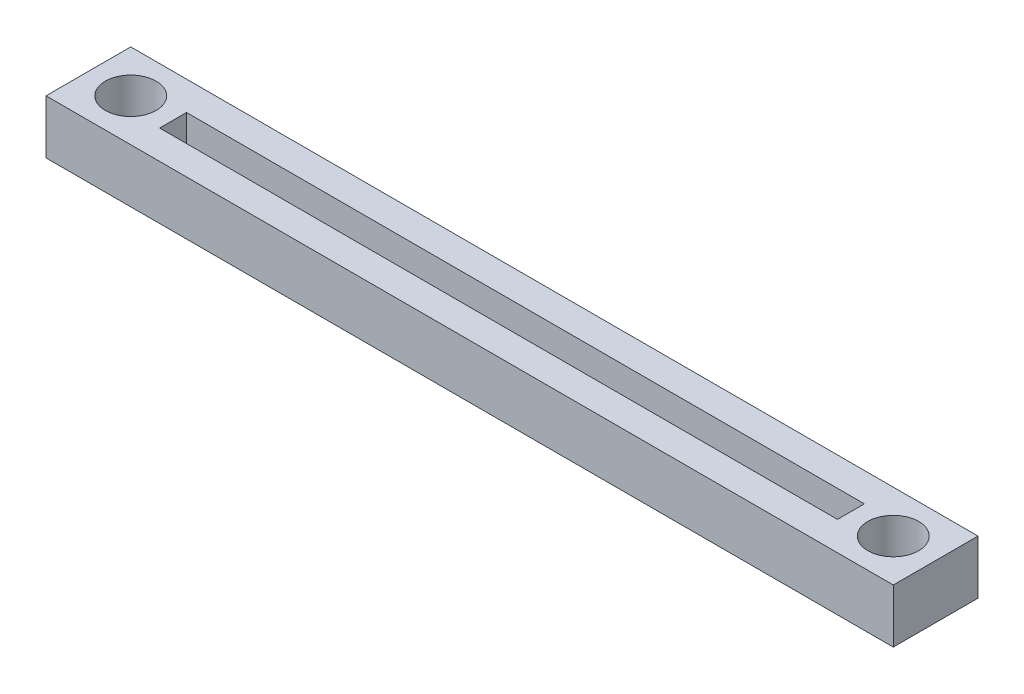
ISO-10303-21;
HEADER;
FILE_DESCRIPTION(('STEP AP214'),'2;1');
FILE_NAME('part.step','',(''),(''),'','','');
FILE_SCHEMA(('AUTOMOTIVE_DESIGN { 1 0 10303 214 1 1 1 1 }'));
ENDSEC;
DATA;
#1=APPLICATION_CONTEXT('core data for automotive mechanical design processes');
#2=APPLICATION_PROTOCOL_DEFINITION('international standard','automotive_design',2000,#1);
#3=PRODUCT_CONTEXT('',#1,'mechanical');
#4=PRODUCT('Part','Part','',(#3));
#5=PRODUCT_RELATED_PRODUCT_CATEGORY('part','',(#4));
#6=PRODUCT_DEFINITION_FORMATION('','',#4);
#7=PRODUCT_DEFINITION_CONTEXT('part definition',#1,'design');
#8=PRODUCT_DEFINITION('design','',#6,#7);
#9=PRODUCT_DEFINITION_SHAPE('','',#8);
#10=(LENGTH_UNIT() NAMED_UNIT(*) SI_UNIT(.MILLI.,.METRE.));
#11=(NAMED_UNIT(*) PLANE_ANGLE_UNIT() SI_UNIT($,.RADIAN.));
#12=(NAMED_UNIT(*) SI_UNIT($,.STERADIAN.) SOLID_ANGLE_UNIT());
#13=UNCERTAINTY_MEASURE_WITH_UNIT(LENGTH_MEASURE(1.E-05),#10,'distance_accuracy_value','');
#14=(GEOMETRIC_REPRESENTATION_CONTEXT(3) GLOBAL_UNCERTAINTY_ASSIGNED_CONTEXT((#13)) GLOBAL_UNIT_ASSIGNED_CONTEXT((#10,
#11,#12)) REPRESENTATION_CONTEXT('',''));
#15=CARTESIAN_POINT('',(0.,0.,0.));
#16=DIRECTION('',(0.,0.,1.));
#17=DIRECTION('',(1.,0.,0.));
#18=AXIS2_PLACEMENT_3D('',#15,#16,#17);
#19=CARTESIAN_POINT('',(50.,6.35,-5.));
#20=DIRECTION('',(-1.,0.,0.));
#21=DIRECTION('',(0.,0.,1.));
#22=AXIS2_PLACEMENT_3D('',#19,#20,#21);
#23=PLANE('',#22);
#24=DIRECTION('',(0.,0.,-1.));
#25=VECTOR('',#24,1.);
#26=CARTESIAN_POINT('',(50.,0.,-5.));
#27=LINE('',#26,#25);
#28=CARTESIAN_POINT('',(50.,0.,5.));
#29=VERTEX_POINT('',#28);
#30=CARTESIAN_POINT('',(50.,0.,-5.));
#31=VERTEX_POINT('',#30);
#32=EDGE_CURVE('E138',#29,#31,#27,.T.);
#33=ORIENTED_EDGE('',*,*,#32,.T.);
#34=DIRECTION('',(0.,-1.,0.));
#35=VECTOR('',#34,1.);
#36=CARTESIAN_POINT('',(50.,6.35,-5.));
#37=LINE('',#36,#35);
#38=CARTESIAN_POINT('',(50.,6.35,-5.));
#39=VERTEX_POINT('',#38);
#40=EDGE_CURVE('E11',#39,#31,#37,.T.);
#41=ORIENTED_EDGE('',*,*,#40,.F.);
#42=DIRECTION('',(0.,0.,-1.));
#43=VECTOR('',#42,1.);
#44=CARTESIAN_POINT('',(50.,6.35,-5.));
#45=LINE('',#44,#43);
#46=CARTESIAN_POINT('',(50.,6.35,5.));
#47=VERTEX_POINT('',#46);
#48=EDGE_CURVE('E142',#47,#39,#45,.T.);
#49=ORIENTED_EDGE('',*,*,#48,.F.);
#50=DIRECTION('',(0.,-1.,0.));
#51=VECTOR('',#50,1.);
#52=CARTESIAN_POINT('',(50.,6.35,5.));
#53=LINE('',#52,#51);
#54=EDGE_CURVE('E152',#47,#29,#53,.T.);
#55=ORIENTED_EDGE('',*,*,#54,.T.);
#56=EDGE_LOOP('',(#33,#41,#49,#55));
#57=FACE_BOUND('',#56,.T.);
#58=ADVANCED_FACE('F37',(#57),#23,.F.);
#59=CARTESIAN_POINT('',(-50.,6.35,-5.));
#60=DIRECTION('',(0.,0.,1.));
#61=DIRECTION('',(1.,0.,0.));
#62=AXIS2_PLACEMENT_3D('',#59,#60,#61);
#63=PLANE('',#62);
#64=DIRECTION('',(-1.,0.,0.));
#65=VECTOR('',#64,1.);
#66=CARTESIAN_POINT('',(-50.,0.,-5.));
#67=LINE('',#66,#65);
#68=CARTESIAN_POINT('',(-50.,0.,-5.));
#69=VERTEX_POINT('',#68);
#70=EDGE_CURVE('E155',#31,#69,#67,.T.);
#71=ORIENTED_EDGE('',*,*,#70,.T.);
#72=DIRECTION('',(0.,-1.,0.));
#73=VECTOR('',#72,1.);
#74=CARTESIAN_POINT('',(-50.,6.35,-5.));
#75=LINE('',#74,#73);
#76=CARTESIAN_POINT('',(-50.,6.35,-5.));
#77=VERTEX_POINT('',#76);
#78=EDGE_CURVE('E45',#77,#69,#75,.T.);
#79=ORIENTED_EDGE('',*,*,#78,.F.);
#80=DIRECTION('',(-1.,0.,0.));
#81=VECTOR('',#80,1.);
#82=CARTESIAN_POINT('',(-50.,6.35,-5.));
#83=LINE('',#82,#81);
#84=EDGE_CURVE('E145',#39,#77,#83,.T.);
#85=ORIENTED_EDGE('',*,*,#84,.F.);
#86=ORIENTED_EDGE('',*,*,#40,.T.);
#87=EDGE_LOOP('',(#71,#79,#85,#86));
#88=FACE_BOUND('',#87,.T.);
#89=ADVANCED_FACE('F184',(#88),#63,.F.);
#90=CARTESIAN_POINT('',(-50.,6.35,-5.));
#91=DIRECTION('',(1.,0.,0.));
#92=DIRECTION('',(0.,0.,-1.));
#93=AXIS2_PLACEMENT_3D('',#90,#91,#92);
#94=PLANE('',#93);
#95=DIRECTION('',(0.,0.,1.));
#96=VECTOR('',#95,1.);
#97=CARTESIAN_POINT('',(-50.,0.,-5.));
#98=LINE('',#97,#96);
#99=CARTESIAN_POINT('',(-50.,0.,5.));
#100=VERTEX_POINT('',#99);
#101=EDGE_CURVE('E157',#69,#100,#98,.T.);
#102=ORIENTED_EDGE('',*,*,#101,.T.);
#103=DIRECTION('',(0.,-1.,0.));
#104=VECTOR('',#103,1.);
#105=CARTESIAN_POINT('',(-50.,6.35,5.));
#106=LINE('',#105,#104);
#107=CARTESIAN_POINT('',(-50.,6.35,5.));
#108=VERTEX_POINT('',#107);
#109=EDGE_CURVE('E162',#108,#100,#106,.T.);
#110=ORIENTED_EDGE('',*,*,#109,.F.);
#111=DIRECTION('',(0.,0.,1.));
#112=VECTOR('',#111,1.);
#113=CARTESIAN_POINT('',(-50.,6.35,-5.));
#114=LINE('',#113,#112);
#115=EDGE_CURVE('E148',#77,#108,#114,.T.);
#116=ORIENTED_EDGE('',*,*,#115,.F.);
#117=ORIENTED_EDGE('',*,*,#78,.T.);
#118=EDGE_LOOP('',(#102,#110,#116,#117));
#119=FACE_BOUND('',#118,.T.);
#120=ADVANCED_FACE('F170',(#119),#94,.F.);
#121=CARTESIAN_POINT('',(-50.,6.35,5.));
#122=DIRECTION('',(0.,0.,-1.));
#123=DIRECTION('',(-1.,0.,0.));
#124=AXIS2_PLACEMENT_3D('',#121,#122,#123);
#125=PLANE('',#124);
#126=DIRECTION('',(1.,0.,0.));
#127=VECTOR('',#126,1.);
#128=CARTESIAN_POINT('',(-50.,0.,5.));
#129=LINE('',#128,#127);
#130=EDGE_CURVE('E146',#100,#29,#129,.T.);
#131=ORIENTED_EDGE('',*,*,#130,.T.);
#132=ORIENTED_EDGE('',*,*,#54,.F.);
#133=DIRECTION('',(1.,0.,0.));
#134=VECTOR('',#133,1.);
#135=CARTESIAN_POINT('',(-50.,6.35,5.));
#136=LINE('',#135,#134);
#137=EDGE_CURVE('E150',#108,#47,#136,.T.);
#138=ORIENTED_EDGE('',*,*,#137,.F.);
#139=ORIENTED_EDGE('',*,*,#109,.T.);
#140=EDGE_LOOP('',(#131,#132,#138,#139));
#141=FACE_BOUND('',#140,.T.);
#142=ADVANCED_FACE('F177',(#141),#125,.F.);
#143=CARTESIAN_POINT('',(0.,6.35,0.));
#144=DIRECTION('',(0.,1.,0.));
#145=DIRECTION('',(0.,0.,1.));
#146=AXIS2_PLACEMENT_3D('',#143,#144,#145);
#147=PLANE('',#146);
#148=CARTESIAN_POINT('',(-45.,6.35,0.));
#149=DIRECTION('',(0.,1.,0.));
#150=DIRECTION('',(0.,0.,1.));
#151=AXIS2_PLACEMENT_3D('',#148,#149,#150);
#152=CIRCLE('',#151,3.);
#153=CARTESIAN_POINT('',(-45.,6.35,3.));
#154=VERTEX_POINT('',#153);
#155=EDGE_CURVE('E223',#154,#154,#152,.T.);
#156=ORIENTED_EDGE('',*,*,#155,.F.);
#157=EDGE_LOOP('',(#156));
#158=FACE_BOUND('',#157,.T.);
#159=CARTESIAN_POINT('',(45.,6.35,0.));
#160=DIRECTION('',(0.,1.,0.));
#161=DIRECTION('',(0.,0.,1.));
#162=AXIS2_PLACEMENT_3D('',#159,#160,#161);
#163=CIRCLE('',#162,3.);
#164=CARTESIAN_POINT('',(45.,6.35,3.));
#165=VERTEX_POINT('',#164);
#166=EDGE_CURVE('E226',#165,#165,#163,.T.);
#167=ORIENTED_EDGE('',*,*,#166,.F.);
#168=EDGE_LOOP('',(#167));
#169=FACE_BOUND('',#168,.T.);
#170=DIRECTION('',(0.,0.,-1.));
#171=VECTOR('',#170,1.);
#172=CARTESIAN_POINT('',(40.,6.35,-1.5875));
#173=LINE('',#172,#171);
#174=CARTESIAN_POINT('',(40.,6.35,1.5875));
#175=VERTEX_POINT('',#174);
#176=CARTESIAN_POINT('',(40.,6.35,-1.5875));
#177=VERTEX_POINT('',#176);
#178=EDGE_CURVE('E52',#175,#177,#173,.T.);
#179=ORIENTED_EDGE('',*,*,#178,.F.);
#180=DIRECTION('',(1.,0.,0.));
#181=VECTOR('',#180,1.);
#182=CARTESIAN_POINT('',(-40.,6.35,1.5875));
#183=LINE('',#182,#181);
#184=CARTESIAN_POINT('',(-40.,6.35,1.5875));
#185=VERTEX_POINT('',#184);
#186=EDGE_CURVE('E120',#185,#175,#183,.T.);
#187=ORIENTED_EDGE('',*,*,#186,.F.);
#188=DIRECTION('',(0.,0.,1.));
#189=VECTOR('',#188,1.);
#190=CARTESIAN_POINT('',(-40.,6.35,-1.5875));
#191=LINE('',#190,#189);
#192=CARTESIAN_POINT('',(-40.,6.35,-1.5875));
#193=VERTEX_POINT('',#192);
#194=EDGE_CURVE('E123',#193,#185,#191,.T.);
#195=ORIENTED_EDGE('',*,*,#194,.F.);
#196=DIRECTION('',(-1.,0.,0.));
#197=VECTOR('',#196,1.);
#198=CARTESIAN_POINT('',(-40.,6.35,-1.5875));
#199=LINE('',#198,#197);
#200=EDGE_CURVE('E132',#177,#193,#199,.T.);
#201=ORIENTED_EDGE('',*,*,#200,.F.);
#202=EDGE_LOOP('',(#179,#187,#195,#201));
#203=FACE_BOUND('',#202,.T.);
#204=ORIENTED_EDGE('',*,*,#48,.T.);
#205=ORIENTED_EDGE('',*,*,#84,.T.);
#206=ORIENTED_EDGE('',*,*,#115,.T.);
#207=ORIENTED_EDGE('',*,*,#137,.T.);
#208=EDGE_LOOP('',(#204,#205,#206,#207));
#209=FACE_BOUND('',#208,.T.);
#210=ADVANCED_FACE('F183',(#158,#169,#203,#209),#147,.T.);
#211=CARTESIAN_POINT('',(0.,0.,0.));
#212=DIRECTION('',(0.,1.,0.));
#213=DIRECTION('',(0.,0.,1.));
#214=AXIS2_PLACEMENT_3D('',#211,#212,#213);
#215=PLANE('',#214);
#216=CARTESIAN_POINT('',(-45.,0.,0.));
#217=DIRECTION('',(0.,1.,0.));
#218=DIRECTION('',(0.,0.,1.));
#219=AXIS2_PLACEMENT_3D('',#216,#217,#218);
#220=CIRCLE('',#219,3.);
#221=CARTESIAN_POINT('',(-45.,0.,3.));
#222=VERTEX_POINT('',#221);
#223=EDGE_CURVE('E40',#222,#222,#220,.T.);
#224=ORIENTED_EDGE('',*,*,#223,.T.);
#225=EDGE_LOOP('',(#224));
#226=FACE_BOUND('',#225,.T.);
#227=CARTESIAN_POINT('',(45.,0.,0.));
#228=DIRECTION('',(0.,1.,0.));
#229=DIRECTION('',(0.,0.,1.));
#230=AXIS2_PLACEMENT_3D('',#227,#228,#229);
#231=CIRCLE('',#230,3.);
#232=CARTESIAN_POINT('',(45.,0.,3.));
#233=VERTEX_POINT('',#232);
#234=EDGE_CURVE('E126',#233,#233,#231,.T.);
#235=ORIENTED_EDGE('',*,*,#234,.T.);
#236=EDGE_LOOP('',(#235));
#237=FACE_BOUND('',#236,.T.);
#238=DIRECTION('',(1.,0.,0.));
#239=VECTOR('',#238,1.);
#240=CARTESIAN_POINT('',(-40.,0.,1.5875));
#241=LINE('',#240,#239);
#242=CARTESIAN_POINT('',(-40.,0.,1.5875));
#243=VERTEX_POINT('',#242);
#244=CARTESIAN_POINT('',(40.,0.,1.5875));
#245=VERTEX_POINT('',#244);
#246=EDGE_CURVE('E110',#243,#245,#241,.T.);
#247=ORIENTED_EDGE('',*,*,#246,.T.);
#248=DIRECTION('',(0.,0.,-1.));
#249=VECTOR('',#248,1.);
#250=CARTESIAN_POINT('',(40.,0.,-1.5875));
#251=LINE('',#250,#249);
#252=CARTESIAN_POINT('',(40.,0.,-1.5875));
#253=VERTEX_POINT('',#252);
#254=EDGE_CURVE('E104',#245,#253,#251,.T.);
#255=ORIENTED_EDGE('',*,*,#254,.T.);
#256=DIRECTION('',(-1.,0.,0.));
#257=VECTOR('',#256,1.);
#258=CARTESIAN_POINT('',(-40.,0.,-1.5875));
#259=LINE('',#258,#257);
#260=CARTESIAN_POINT('',(-40.,0.,-1.5875));
#261=VERTEX_POINT('',#260);
#262=EDGE_CURVE('E113',#253,#261,#259,.T.);
#263=ORIENTED_EDGE('',*,*,#262,.T.);
#264=DIRECTION('',(0.,0.,1.));
#265=VECTOR('',#264,1.);
#266=CARTESIAN_POINT('',(-40.,0.,-1.5875));
#267=LINE('',#266,#265);
#268=EDGE_CURVE('E60',#261,#243,#267,.T.);
#269=ORIENTED_EDGE('',*,*,#268,.T.);
#270=EDGE_LOOP('',(#247,#255,#263,#269));
#271=FACE_BOUND('',#270,.T.);
#272=ORIENTED_EDGE('',*,*,#32,.F.);
#273=ORIENTED_EDGE('',*,*,#130,.F.);
#274=ORIENTED_EDGE('',*,*,#101,.F.);
#275=ORIENTED_EDGE('',*,*,#70,.F.);
#276=EDGE_LOOP('',(#272,#273,#274,#275));
#277=FACE_BOUND('',#276,.T.);
#278=ADVANCED_FACE('F117',(#226,#237,#271,#277),#215,.F.);
#279=CARTESIAN_POINT('',(40.,0.,-1.5875));
#280=DIRECTION('',(1.,0.,0.));
#281=DIRECTION('',(0.,0.,-1.));
#282=AXIS2_PLACEMENT_3D('',#279,#280,#281);
#283=PLANE('',#282);
#284=ORIENTED_EDGE('',*,*,#178,.T.);
#285=DIRECTION('',(0.,1.,0.));
#286=VECTOR('',#285,1.);
#287=CARTESIAN_POINT('',(40.,0.,-1.5875));
#288=LINE('',#287,#286);
#289=EDGE_CURVE('E100',#253,#177,#288,.T.);
#290=ORIENTED_EDGE('',*,*,#289,.F.);
#291=ORIENTED_EDGE('',*,*,#254,.F.);
#292=DIRECTION('',(0.,1.,0.));
#293=VECTOR('',#292,1.);
#294=CARTESIAN_POINT('',(40.,0.,1.5875));
#295=LINE('',#294,#293);
#296=EDGE_CURVE('E136',#245,#175,#295,.T.);
#297=ORIENTED_EDGE('',*,*,#296,.T.);
#298=EDGE_LOOP('',(#284,#290,#291,#297));
#299=FACE_BOUND('',#298,.T.);
#300=ADVANCED_FACE('F102',(#299),#283,.F.);
#301=CARTESIAN_POINT('',(-40.,0.,1.5875));
#302=DIRECTION('',(0.,0.,1.));
#303=DIRECTION('',(1.,0.,0.));
#304=AXIS2_PLACEMENT_3D('',#301,#302,#303);
#305=PLANE('',#304);
#306=ORIENTED_EDGE('',*,*,#186,.T.);
#307=ORIENTED_EDGE('',*,*,#296,.F.);
#308=ORIENTED_EDGE('',*,*,#246,.F.);
#309=DIRECTION('',(0.,1.,0.));
#310=VECTOR('',#309,1.);
#311=CARTESIAN_POINT('',(-40.,0.,1.5875));
#312=LINE('',#311,#310);
#313=EDGE_CURVE('E139',#243,#185,#312,.T.);
#314=ORIENTED_EDGE('',*,*,#313,.T.);
#315=EDGE_LOOP('',(#306,#307,#308,#314));
#316=FACE_BOUND('',#315,.T.);
#317=ADVANCED_FACE('F202',(#316),#305,.F.);
#318=CARTESIAN_POINT('',(-40.,0.,-1.5875));
#319=DIRECTION('',(-1.,0.,0.));
#320=DIRECTION('',(0.,0.,1.));
#321=AXIS2_PLACEMENT_3D('',#318,#319,#320);
#322=PLANE('',#321);
#323=ORIENTED_EDGE('',*,*,#194,.T.);
#324=ORIENTED_EDGE('',*,*,#313,.F.);
#325=ORIENTED_EDGE('',*,*,#268,.F.);
#326=DIRECTION('',(0.,1.,0.));
#327=VECTOR('',#326,1.);
#328=CARTESIAN_POINT('',(-40.,0.,-1.5875));
#329=LINE('',#328,#327);
#330=EDGE_CURVE('E109',#261,#193,#329,.T.);
#331=ORIENTED_EDGE('',*,*,#330,.T.);
#332=EDGE_LOOP('',(#323,#324,#325,#331));
#333=FACE_BOUND('',#332,.T.);
#334=ADVANCED_FACE('F206',(#333),#322,.F.);
#335=CARTESIAN_POINT('',(-40.,0.,-1.5875));
#336=DIRECTION('',(0.,0.,-1.));
#337=DIRECTION('',(-1.,0.,0.));
#338=AXIS2_PLACEMENT_3D('',#335,#336,#337);
#339=PLANE('',#338);
#340=ORIENTED_EDGE('',*,*,#200,.T.);
#341=ORIENTED_EDGE('',*,*,#330,.F.);
#342=ORIENTED_EDGE('',*,*,#262,.F.);
#343=ORIENTED_EDGE('',*,*,#289,.T.);
#344=EDGE_LOOP('',(#340,#341,#342,#343));
#345=FACE_BOUND('',#344,.T.);
#346=ADVANCED_FACE('F114',(#345),#339,.F.);
#347=CARTESIAN_POINT('',(45.,6.35,0.));
#348=DIRECTION('',(0.,1.,0.));
#349=DIRECTION('',(0.,0.,1.));
#350=AXIS2_PLACEMENT_3D('',#347,#348,#349);
#351=CYLINDRICAL_SURFACE('',#350,3.);
#352=ORIENTED_EDGE('',*,*,#166,.T.);
#353=EDGE_LOOP('',(#352));
#354=FACE_BOUND('',#353,.T.);
#355=ORIENTED_EDGE('',*,*,#234,.F.);
#356=EDGE_LOOP('',(#355));
#357=FACE_BOUND('',#356,.T.);
#358=ADVANCED_FACE('F205',(#354,#357),#351,.F.);
#359=CARTESIAN_POINT('',(-45.,6.35,0.));
#360=DIRECTION('',(0.,1.,0.));
#361=DIRECTION('',(0.,0.,1.));
#362=AXIS2_PLACEMENT_3D('',#359,#360,#361);
#363=CYLINDRICAL_SURFACE('',#362,3.);
#364=ORIENTED_EDGE('',*,*,#155,.T.);
#365=EDGE_LOOP('',(#364));
#366=FACE_BOUND('',#365,.T.);
#367=ORIENTED_EDGE('',*,*,#223,.F.);
#368=EDGE_LOOP('',(#367));
#369=FACE_BOUND('',#368,.T.);
#370=ADVANCED_FACE('F214',(#366,#369),#363,.F.);
#371=CLOSED_SHELL('',(#58,#89,#120,#142,#210,#278,#300,#317,#334,#346,#358,#370));
#372=MANIFOLD_SOLID_BREP('B2',#371);
#373=ADVANCED_BREP_SHAPE_REPRESENTATION('',(#18,#372),#14);
#374=SHAPE_DEFINITION_REPRESENTATION(#9,#373);
ENDSEC;
END-ISO-10303-21;
